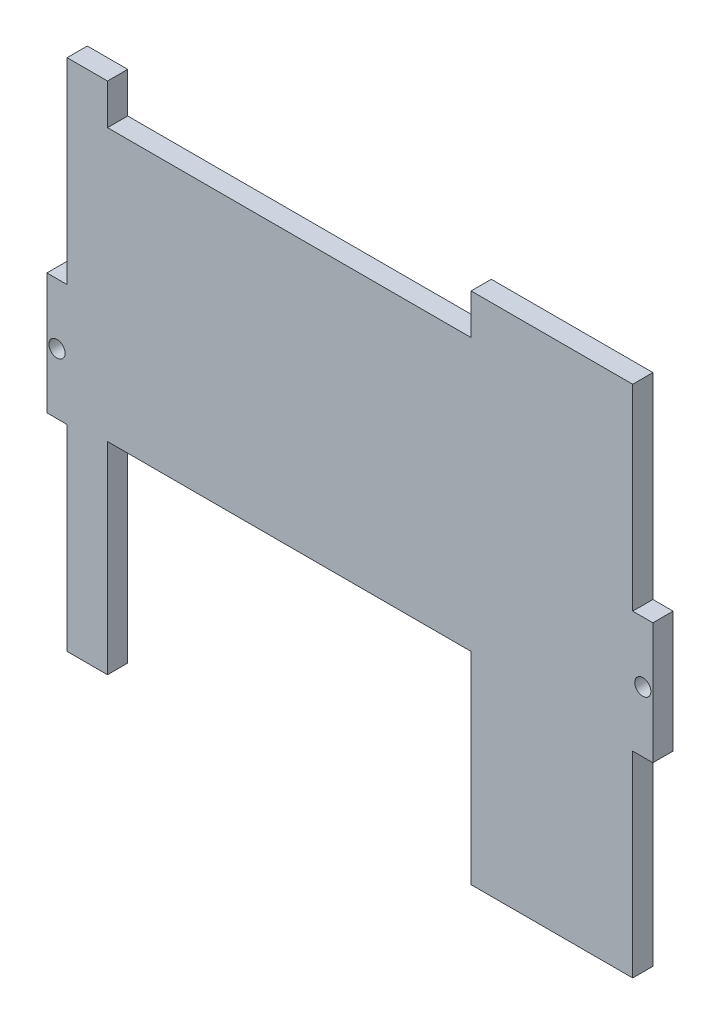
ISO-10303-21;
HEADER;
FILE_DESCRIPTION(('STEP AP214'),'2;1');
FILE_NAME('part.step','',(''),(''),'','','');
FILE_SCHEMA(('AUTOMOTIVE_DESIGN { 1 0 10303 214 1 1 1 1 }'));
ENDSEC;
DATA;
#1=APPLICATION_CONTEXT('core data for automotive mechanical design processes');
#2=APPLICATION_PROTOCOL_DEFINITION('international standard','automotive_design',2000,#1);
#3=PRODUCT_CONTEXT('',#1,'mechanical');
#4=PRODUCT('Part','Part','',(#3));
#5=PRODUCT_RELATED_PRODUCT_CATEGORY('part','',(#4));
#6=PRODUCT_DEFINITION_FORMATION('','',#4);
#7=PRODUCT_DEFINITION_CONTEXT('part definition',#1,'design');
#8=PRODUCT_DEFINITION('design','',#6,#7);
#9=PRODUCT_DEFINITION_SHAPE('','',#8);
#10=(LENGTH_UNIT() NAMED_UNIT(*) SI_UNIT(.MILLI.,.METRE.));
#11=(NAMED_UNIT(*) PLANE_ANGLE_UNIT() SI_UNIT($,.RADIAN.));
#12=(NAMED_UNIT(*) SI_UNIT($,.STERADIAN.) SOLID_ANGLE_UNIT());
#13=UNCERTAINTY_MEASURE_WITH_UNIT(LENGTH_MEASURE(1.E-05),#10,'distance_accuracy_value','');
#14=(GEOMETRIC_REPRESENTATION_CONTEXT(3) GLOBAL_UNCERTAINTY_ASSIGNED_CONTEXT((#13)) GLOBAL_UNIT_ASSIGNED_CONTEXT((#10,
#11,#12)) REPRESENTATION_CONTEXT('',''));
#15=CARTESIAN_POINT('',(0.,0.,0.));
#16=DIRECTION('',(0.,0.,1.));
#17=DIRECTION('',(1.,0.,0.));
#18=AXIS2_PLACEMENT_3D('',#15,#16,#17);
#19=CARTESIAN_POINT('',(0.,-63.64,5.));
#20=DIRECTION('',(0.,1.,0.));
#21=DIRECTION('',(0.,0.,1.));
#22=AXIS2_PLACEMENT_3D('',#19,#20,#21);
#23=PLANE('',#22);
#24=DIRECTION('',(1.,0.,0.));
#25=VECTOR('',#24,1.);
#26=CARTESIAN_POINT('',(0.,-63.64,5.));
#27=LINE('',#26,#25);
#28=CARTESIAN_POINT('',(30.,-63.64,5.));
#29=VERTEX_POINT('',#28);
#30=CARTESIAN_POINT('',(70.,-63.64,5.));
#31=VERTEX_POINT('',#30);
#32=EDGE_CURVE('E274',#29,#31,#27,.T.);
#33=ORIENTED_EDGE('',*,*,#32,.F.);
#34=DIRECTION('',(0.,0.,1.));
#35=VECTOR('',#34,1.);
#36=CARTESIAN_POINT('',(30.,-63.64,0.));
#37=LINE('',#36,#35);
#38=CARTESIAN_POINT('',(30.,-63.64,0.));
#39=VERTEX_POINT('',#38);
#40=EDGE_CURVE('E201',#39,#29,#37,.T.);
#41=ORIENTED_EDGE('',*,*,#40,.F.);
#42=DIRECTION('',(1.,0.,0.));
#43=VECTOR('',#42,1.);
#44=CARTESIAN_POINT('',(0.,-63.64,0.));
#45=LINE('',#44,#43);
#46=CARTESIAN_POINT('',(70.,-63.64,0.));
#47=VERTEX_POINT('',#46);
#48=EDGE_CURVE('E192',#39,#47,#45,.T.);
#49=ORIENTED_EDGE('',*,*,#48,.T.);
#50=DIRECTION('',(0.,0.,-1.));
#51=VECTOR('',#50,1.);
#52=CARTESIAN_POINT('',(70.,-63.64,5.));
#53=LINE('',#52,#51);
#54=EDGE_CURVE('E278',#31,#47,#53,.T.);
#55=ORIENTED_EDGE('',*,*,#54,.F.);
#56=EDGE_LOOP('',(#33,#41,#49,#55));
#57=FACE_BOUND('',#56,.T.);
#58=ADVANCED_FACE('F35',(#57),#23,.F.);
#59=CARTESIAN_POINT('',(0.,63.64,5.));
#60=DIRECTION('',(0.,1.,0.));
#61=DIRECTION('',(0.,0.,1.));
#62=AXIS2_PLACEMENT_3D('',#59,#60,#61);
#63=PLANE('',#62);
#64=DIRECTION('',(0.,0.,1.));
#65=VECTOR('',#64,1.);
#66=CARTESIAN_POINT('',(-60.,63.64,0.));
#67=LINE('',#66,#65);
#68=CARTESIAN_POINT('',(-60.,63.64,0.));
#69=VERTEX_POINT('',#68);
#70=CARTESIAN_POINT('',(-60.,63.64,5.));
#71=VERTEX_POINT('',#70);
#72=EDGE_CURVE('E223',#69,#71,#67,.T.);
#73=ORIENTED_EDGE('',*,*,#72,.F.);
#74=DIRECTION('',(1.,0.,0.));
#75=VECTOR('',#74,1.);
#76=CARTESIAN_POINT('',(0.,63.64,0.));
#77=LINE('',#76,#75);
#78=CARTESIAN_POINT('',(-70.,63.64,0.));
#79=VERTEX_POINT('',#78);
#80=EDGE_CURVE('E292',#79,#69,#77,.T.);
#81=ORIENTED_EDGE('',*,*,#80,.F.);
#82=DIRECTION('',(0.,0.,-1.));
#83=VECTOR('',#82,1.);
#84=CARTESIAN_POINT('',(-70.,63.64,5.));
#85=LINE('',#84,#83);
#86=CARTESIAN_POINT('',(-70.,63.64,5.));
#87=VERTEX_POINT('',#86);
#88=EDGE_CURVE('E324',#87,#79,#85,.T.);
#89=ORIENTED_EDGE('',*,*,#88,.F.);
#90=DIRECTION('',(1.,0.,0.));
#91=VECTOR('',#90,1.);
#92=CARTESIAN_POINT('',(0.,63.64,5.));
#93=LINE('',#92,#91);
#94=EDGE_CURVE('E259',#87,#71,#93,.T.);
#95=ORIENTED_EDGE('',*,*,#94,.T.);
#96=EDGE_LOOP('',(#73,#81,#89,#95));
#97=FACE_BOUND('',#96,.T.);
#98=ADVANCED_FACE('F371',(#97),#63,.T.);
#99=CARTESIAN_POINT('',(70.,0.,5.));
#100=DIRECTION('',(1.,0.,0.));
#101=DIRECTION('',(0.,0.,-1.));
#102=AXIS2_PLACEMENT_3D('',#99,#100,#101);
#103=PLANE('',#102);
#104=DIRECTION('',(0.,-1.,0.));
#105=VECTOR('',#104,1.);
#106=CARTESIAN_POINT('',(70.,0.,0.));
#107=LINE('',#106,#105);
#108=CARTESIAN_POINT('',(70.,-15.,0.));
#109=VERTEX_POINT('',#108);
#110=EDGE_CURVE('E241',#109,#47,#107,.T.);
#111=ORIENTED_EDGE('',*,*,#110,.F.);
#112=DIRECTION('',(0.,0.,-1.));
#113=VECTOR('',#112,1.);
#114=CARTESIAN_POINT('',(70.,-15.,5.));
#115=LINE('',#114,#113);
#116=CARTESIAN_POINT('',(70.,-15.,5.));
#117=VERTEX_POINT('',#116);
#118=EDGE_CURVE('E11',#117,#109,#115,.T.);
#119=ORIENTED_EDGE('',*,*,#118,.F.);
#120=DIRECTION('',(0.,-1.,0.));
#121=VECTOR('',#120,1.);
#122=CARTESIAN_POINT('',(70.,0.,5.));
#123=LINE('',#122,#121);
#124=EDGE_CURVE('E244',#117,#31,#123,.T.);
#125=ORIENTED_EDGE('',*,*,#124,.T.);
#126=ORIENTED_EDGE('',*,*,#54,.T.);
#127=EDGE_LOOP('',(#111,#119,#125,#126));
#128=FACE_BOUND('',#127,.T.);
#129=ADVANCED_FACE('F37',(#128),#103,.T.);
#130=CARTESIAN_POINT('',(0.,-15.,5.));
#131=DIRECTION('',(0.,1.,0.));
#132=DIRECTION('',(0.,0.,1.));
#133=AXIS2_PLACEMENT_3D('',#130,#131,#132);
#134=PLANE('',#133);
#135=DIRECTION('',(1.,0.,0.));
#136=VECTOR('',#135,1.);
#137=CARTESIAN_POINT('',(0.,-15.,0.));
#138=LINE('',#137,#136);
#139=CARTESIAN_POINT('',(75.,-15.,0.));
#140=VERTEX_POINT('',#139);
#141=EDGE_CURVE('E280',#109,#140,#138,.T.);
#142=ORIENTED_EDGE('',*,*,#141,.T.);
#143=DIRECTION('',(0.,0.,-1.));
#144=VECTOR('',#143,1.);
#145=CARTESIAN_POINT('',(75.,-15.,5.));
#146=LINE('',#145,#144);
#147=CARTESIAN_POINT('',(75.,-15.,5.));
#148=VERTEX_POINT('',#147);
#149=EDGE_CURVE('E43',#148,#140,#146,.T.);
#150=ORIENTED_EDGE('',*,*,#149,.F.);
#151=DIRECTION('',(1.,0.,0.));
#152=VECTOR('',#151,1.);
#153=CARTESIAN_POINT('',(0.,-15.,5.));
#154=LINE('',#153,#152);
#155=EDGE_CURVE('E247',#117,#148,#154,.T.);
#156=ORIENTED_EDGE('',*,*,#155,.F.);
#157=ORIENTED_EDGE('',*,*,#118,.T.);
#158=EDGE_LOOP('',(#142,#150,#156,#157));
#159=FACE_BOUND('',#158,.T.);
#160=ADVANCED_FACE('F473',(#159),#134,.F.);
#161=CARTESIAN_POINT('',(75.,0.,5.));
#162=DIRECTION('',(-1.,0.,0.));
#163=DIRECTION('',(0.,0.,1.));
#164=AXIS2_PLACEMENT_3D('',#161,#162,#163);
#165=PLANE('',#164);
#166=DIRECTION('',(0.,1.,0.));
#167=VECTOR('',#166,1.);
#168=CARTESIAN_POINT('',(75.,0.,0.));
#169=LINE('',#168,#167);
#170=CARTESIAN_POINT('',(75.,15.,0.));
#171=VERTEX_POINT('',#170);
#172=EDGE_CURVE('E282',#140,#171,#169,.T.);
#173=ORIENTED_EDGE('',*,*,#172,.T.);
#174=DIRECTION('',(0.,0.,-1.));
#175=VECTOR('',#174,1.);
#176=CARTESIAN_POINT('',(75.,15.,5.));
#177=LINE('',#176,#175);
#178=CARTESIAN_POINT('',(75.,15.,5.));
#179=VERTEX_POINT('',#178);
#180=EDGE_CURVE('E331',#179,#171,#177,.T.);
#181=ORIENTED_EDGE('',*,*,#180,.F.);
#182=DIRECTION('',(0.,1.,0.));
#183=VECTOR('',#182,1.);
#184=CARTESIAN_POINT('',(75.,0.,5.));
#185=LINE('',#184,#183);
#186=EDGE_CURVE('E250',#148,#179,#185,.T.);
#187=ORIENTED_EDGE('',*,*,#186,.F.);
#188=ORIENTED_EDGE('',*,*,#149,.T.);
#189=EDGE_LOOP('',(#173,#181,#187,#188));
#190=FACE_BOUND('',#189,.T.);
#191=ADVANCED_FACE('F337',(#190),#165,.F.);
#192=CARTESIAN_POINT('',(0.,15.,5.));
#193=DIRECTION('',(0.,1.,0.));
#194=DIRECTION('',(0.,0.,1.));
#195=AXIS2_PLACEMENT_3D('',#192,#193,#194);
#196=PLANE('',#195);
#197=DIRECTION('',(1.,0.,0.));
#198=VECTOR('',#197,1.);
#199=CARTESIAN_POINT('',(0.,15.,0.));
#200=LINE('',#199,#198);
#201=CARTESIAN_POINT('',(70.,15.,0.));
#202=VERTEX_POINT('',#201);
#203=EDGE_CURVE('E285',#202,#171,#200,.T.);
#204=ORIENTED_EDGE('',*,*,#203,.F.);
#205=DIRECTION('',(0.,0.,-1.));
#206=VECTOR('',#205,1.);
#207=CARTESIAN_POINT('',(70.,15.,5.));
#208=LINE('',#207,#206);
#209=CARTESIAN_POINT('',(70.,15.,5.));
#210=VERTEX_POINT('',#209);
#211=EDGE_CURVE('E329',#210,#202,#208,.T.);
#212=ORIENTED_EDGE('',*,*,#211,.F.);
#213=DIRECTION('',(1.,0.,0.));
#214=VECTOR('',#213,1.);
#215=CARTESIAN_POINT('',(0.,15.,5.));
#216=LINE('',#215,#214);
#217=EDGE_CURVE('E252',#210,#179,#216,.T.);
#218=ORIENTED_EDGE('',*,*,#217,.T.);
#219=ORIENTED_EDGE('',*,*,#180,.T.);
#220=EDGE_LOOP('',(#204,#212,#218,#219));
#221=FACE_BOUND('',#220,.T.);
#222=ADVANCED_FACE('F346',(#221),#196,.T.);
#223=CARTESIAN_POINT('',(70.,0.,5.));
#224=DIRECTION('',(1.,0.,0.));
#225=DIRECTION('',(0.,0.,-1.));
#226=AXIS2_PLACEMENT_3D('',#223,#224,#225);
#227=PLANE('',#226);
#228=DIRECTION('',(0.,-1.,0.));
#229=VECTOR('',#228,1.);
#230=CARTESIAN_POINT('',(70.,0.,0.));
#231=LINE('',#230,#229);
#232=CARTESIAN_POINT('',(70.,63.64,0.));
#233=VERTEX_POINT('',#232);
#234=EDGE_CURVE('E288',#233,#202,#231,.T.);
#235=ORIENTED_EDGE('',*,*,#234,.F.);
#236=DIRECTION('',(0.,0.,-1.));
#237=VECTOR('',#236,1.);
#238=CARTESIAN_POINT('',(70.,63.64,5.));
#239=LINE('',#238,#237);
#240=CARTESIAN_POINT('',(70.,63.64,5.));
#241=VERTEX_POINT('',#240);
#242=EDGE_CURVE('E326',#241,#233,#239,.T.);
#243=ORIENTED_EDGE('',*,*,#242,.F.);
#244=DIRECTION('',(0.,-1.,0.));
#245=VECTOR('',#244,1.);
#246=CARTESIAN_POINT('',(70.,0.,5.));
#247=LINE('',#246,#245);
#248=EDGE_CURVE('E255',#241,#210,#247,.T.);
#249=ORIENTED_EDGE('',*,*,#248,.T.);
#250=ORIENTED_EDGE('',*,*,#211,.T.);
#251=EDGE_LOOP('',(#235,#243,#249,#250));
#252=FACE_BOUND('',#251,.T.);
#253=ADVANCED_FACE('F355',(#252),#227,.T.);
#254=DIRECTION('',(0.,0.,1.));
#255=VECTOR('',#254,1.);
#256=CARTESIAN_POINT('',(30.,63.64,0.));
#257=LINE('',#256,#255);
#258=CARTESIAN_POINT('',(30.,63.64,0.));
#259=VERTEX_POINT('',#258);
#260=CARTESIAN_POINT('',(30.,63.64,5.));
#261=VERTEX_POINT('',#260);
#262=EDGE_CURVE('E226',#259,#261,#257,.T.);
#263=ORIENTED_EDGE('',*,*,#262,.T.);
#264=EDGE_CURVE('E258',#261,#241,#93,.T.);
#265=ORIENTED_EDGE('',*,*,#264,.T.);
#266=ORIENTED_EDGE('',*,*,#242,.T.);
#267=EDGE_CURVE('E291',#259,#233,#77,.T.);
#268=ORIENTED_EDGE('',*,*,#267,.F.);
#269=EDGE_LOOP('',(#263,#265,#266,#268));
#270=FACE_BOUND('',#269,.T.);
#271=ADVANCED_FACE('F358',(#270),#63,.T.);
#272=CARTESIAN_POINT('',(-70.,0.,5.));
#273=DIRECTION('',(1.,0.,0.));
#274=DIRECTION('',(0.,0.,-1.));
#275=AXIS2_PLACEMENT_3D('',#272,#273,#274);
#276=PLANE('',#275);
#277=DIRECTION('',(0.,-1.,0.));
#278=VECTOR('',#277,1.);
#279=CARTESIAN_POINT('',(-70.,0.,0.));
#280=LINE('',#279,#278);
#281=CARTESIAN_POINT('',(-70.,15.,0.));
#282=VERTEX_POINT('',#281);
#283=EDGE_CURVE('E295',#79,#282,#280,.T.);
#284=ORIENTED_EDGE('',*,*,#283,.T.);
#285=DIRECTION('',(0.,0.,-1.));
#286=VECTOR('',#285,1.);
#287=CARTESIAN_POINT('',(-70.,15.,5.));
#288=LINE('',#287,#286);
#289=CARTESIAN_POINT('',(-70.,15.,5.));
#290=VERTEX_POINT('',#289);
#291=EDGE_CURVE('E322',#290,#282,#288,.T.);
#292=ORIENTED_EDGE('',*,*,#291,.F.);
#293=DIRECTION('',(0.,-1.,0.));
#294=VECTOR('',#293,1.);
#295=CARTESIAN_POINT('',(-70.,0.,5.));
#296=LINE('',#295,#294);
#297=EDGE_CURVE('E262',#87,#290,#296,.T.);
#298=ORIENTED_EDGE('',*,*,#297,.F.);
#299=ORIENTED_EDGE('',*,*,#88,.T.);
#300=EDGE_LOOP('',(#284,#292,#298,#299));
#301=FACE_BOUND('',#300,.T.);
#302=ADVANCED_FACE('F377',(#301),#276,.F.);
#303=CARTESIAN_POINT('',(0.,15.,5.));
#304=DIRECTION('',(0.,1.,0.));
#305=DIRECTION('',(0.,0.,1.));
#306=AXIS2_PLACEMENT_3D('',#303,#304,#305);
#307=PLANE('',#306);
#308=DIRECTION('',(1.,0.,0.));
#309=VECTOR('',#308,1.);
#310=CARTESIAN_POINT('',(0.,15.,0.));
#311=LINE('',#310,#309);
#312=CARTESIAN_POINT('',(-75.,15.,0.));
#313=VERTEX_POINT('',#312);
#314=EDGE_CURVE('E298',#313,#282,#311,.T.);
#315=ORIENTED_EDGE('',*,*,#314,.F.);
#316=DIRECTION('',(0.,0.,-1.));
#317=VECTOR('',#316,1.);
#318=CARTESIAN_POINT('',(-75.,15.,5.));
#319=LINE('',#318,#317);
#320=CARTESIAN_POINT('',(-75.,15.,5.));
#321=VERTEX_POINT('',#320);
#322=EDGE_CURVE('E320',#321,#313,#319,.T.);
#323=ORIENTED_EDGE('',*,*,#322,.F.);
#324=DIRECTION('',(1.,0.,0.));
#325=VECTOR('',#324,1.);
#326=CARTESIAN_POINT('',(0.,15.,5.));
#327=LINE('',#326,#325);
#328=EDGE_CURVE('E264',#321,#290,#327,.T.);
#329=ORIENTED_EDGE('',*,*,#328,.T.);
#330=ORIENTED_EDGE('',*,*,#291,.T.);
#331=EDGE_LOOP('',(#315,#323,#329,#330));
#332=FACE_BOUND('',#331,.T.);
#333=ADVANCED_FACE('F401',(#332),#307,.T.);
#334=CARTESIAN_POINT('',(-75.,0.,5.));
#335=DIRECTION('',(-1.,0.,0.));
#336=DIRECTION('',(0.,0.,1.));
#337=AXIS2_PLACEMENT_3D('',#334,#335,#336);
#338=PLANE('',#337);
#339=DIRECTION('',(0.,1.,0.));
#340=VECTOR('',#339,1.);
#341=CARTESIAN_POINT('',(-75.,0.,0.));
#342=LINE('',#341,#340);
#343=CARTESIAN_POINT('',(-75.,-15.,0.));
#344=VERTEX_POINT('',#343);
#345=EDGE_CURVE('E301',#344,#313,#342,.T.);
#346=ORIENTED_EDGE('',*,*,#345,.F.);
#347=DIRECTION('',(0.,0.,-1.));
#348=VECTOR('',#347,1.);
#349=CARTESIAN_POINT('',(-75.,-15.,5.));
#350=LINE('',#349,#348);
#351=CARTESIAN_POINT('',(-75.,-15.,5.));
#352=VERTEX_POINT('',#351);
#353=EDGE_CURVE('E318',#352,#344,#350,.T.);
#354=ORIENTED_EDGE('',*,*,#353,.F.);
#355=DIRECTION('',(0.,1.,0.));
#356=VECTOR('',#355,1.);
#357=CARTESIAN_POINT('',(-75.,0.,5.));
#358=LINE('',#357,#356);
#359=EDGE_CURVE('E267',#352,#321,#358,.T.);
#360=ORIENTED_EDGE('',*,*,#359,.T.);
#361=ORIENTED_EDGE('',*,*,#322,.T.);
#362=EDGE_LOOP('',(#346,#354,#360,#361));
#363=FACE_BOUND('',#362,.T.);
#364=ADVANCED_FACE('F383',(#363),#338,.T.);
#365=CARTESIAN_POINT('',(0.,-15.,5.));
#366=DIRECTION('',(0.,1.,0.));
#367=DIRECTION('',(0.,0.,1.));
#368=AXIS2_PLACEMENT_3D('',#365,#366,#367);
#369=PLANE('',#368);
#370=DIRECTION('',(1.,0.,0.));
#371=VECTOR('',#370,1.);
#372=CARTESIAN_POINT('',(0.,-15.,0.));
#373=LINE('',#372,#371);
#374=CARTESIAN_POINT('',(-70.,-15.,0.));
#375=VERTEX_POINT('',#374);
#376=EDGE_CURVE('E304',#344,#375,#373,.T.);
#377=ORIENTED_EDGE('',*,*,#376,.T.);
#378=DIRECTION('',(0.,0.,-1.));
#379=VECTOR('',#378,1.);
#380=CARTESIAN_POINT('',(-70.,-15.,5.));
#381=LINE('',#380,#379);
#382=CARTESIAN_POINT('',(-70.,-15.,5.));
#383=VERTEX_POINT('',#382);
#384=EDGE_CURVE('E315',#383,#375,#381,.T.);
#385=ORIENTED_EDGE('',*,*,#384,.F.);
#386=DIRECTION('',(1.,0.,0.));
#387=VECTOR('',#386,1.);
#388=CARTESIAN_POINT('',(0.,-15.,5.));
#389=LINE('',#388,#387);
#390=EDGE_CURVE('E270',#352,#383,#389,.T.);
#391=ORIENTED_EDGE('',*,*,#390,.F.);
#392=ORIENTED_EDGE('',*,*,#353,.T.);
#393=EDGE_LOOP('',(#377,#385,#391,#392));
#394=FACE_BOUND('',#393,.T.);
#395=ADVANCED_FACE('F389',(#394),#369,.F.);
#396=CARTESIAN_POINT('',(-70.,0.,5.));
#397=DIRECTION('',(1.,0.,0.));
#398=DIRECTION('',(0.,0.,-1.));
#399=AXIS2_PLACEMENT_3D('',#396,#397,#398);
#400=PLANE('',#399);
#401=DIRECTION('',(0.,-1.,0.));
#402=VECTOR('',#401,1.);
#403=CARTESIAN_POINT('',(-70.,0.,0.));
#404=LINE('',#403,#402);
#405=CARTESIAN_POINT('',(-70.,-63.64,0.));
#406=VERTEX_POINT('',#405);
#407=EDGE_CURVE('E306',#375,#406,#404,.T.);
#408=ORIENTED_EDGE('',*,*,#407,.T.);
#409=DIRECTION('',(0.,0.,-1.));
#410=VECTOR('',#409,1.);
#411=CARTESIAN_POINT('',(-70.,-63.64,5.));
#412=LINE('',#411,#410);
#413=CARTESIAN_POINT('',(-70.,-63.64,5.));
#414=VERTEX_POINT('',#413);
#415=EDGE_CURVE('E312',#414,#406,#412,.T.);
#416=ORIENTED_EDGE('',*,*,#415,.F.);
#417=DIRECTION('',(0.,-1.,0.));
#418=VECTOR('',#417,1.);
#419=CARTESIAN_POINT('',(-70.,0.,5.));
#420=LINE('',#419,#418);
#421=EDGE_CURVE('E272',#383,#414,#420,.T.);
#422=ORIENTED_EDGE('',*,*,#421,.F.);
#423=ORIENTED_EDGE('',*,*,#384,.T.);
#424=EDGE_LOOP('',(#408,#416,#422,#423));
#425=FACE_BOUND('',#424,.T.);
#426=ADVANCED_FACE('F395',(#425),#400,.F.);
#427=CARTESIAN_POINT('',(-60.,-63.64,0.));
#428=VERTEX_POINT('',#427);
#429=EDGE_CURVE('E248',#406,#428,#45,.T.);
#430=ORIENTED_EDGE('',*,*,#429,.T.);
#431=DIRECTION('',(0.,0.,1.));
#432=VECTOR('',#431,1.);
#433=CARTESIAN_POINT('',(-60.,-63.64,0.));
#434=LINE('',#433,#432);
#435=CARTESIAN_POINT('',(-60.,-63.64,5.));
#436=VERTEX_POINT('',#435);
#437=EDGE_CURVE('E204',#428,#436,#434,.T.);
#438=ORIENTED_EDGE('',*,*,#437,.T.);
#439=EDGE_CURVE('E275',#414,#436,#27,.T.);
#440=ORIENTED_EDGE('',*,*,#439,.F.);
#441=ORIENTED_EDGE('',*,*,#415,.T.);
#442=EDGE_LOOP('',(#430,#438,#440,#441));
#443=FACE_BOUND('',#442,.T.);
#444=ADVANCED_FACE('F399',(#443),#23,.F.);
#445=CARTESIAN_POINT('',(0.,0.,5.));
#446=DIRECTION('',(0.,0.,1.));
#447=DIRECTION('',(1.,0.,0.));
#448=AXIS2_PLACEMENT_3D('',#445,#446,#447);
#449=PLANE('',#448);
#450=DIRECTION('',(0.,1.,0.));
#451=VECTOR('',#450,1.);
#452=CARTESIAN_POINT('',(30.,-13.64,5.));
#453=LINE('',#452,#451);
#454=CARTESIAN_POINT('',(30.,-13.64,5.));
#455=VERTEX_POINT('',#454);
#456=EDGE_CURVE('E177',#29,#455,#453,.T.);
#457=ORIENTED_EDGE('',*,*,#456,.F.);
#458=ORIENTED_EDGE('',*,*,#32,.T.);
#459=ORIENTED_EDGE('',*,*,#124,.F.);
#460=ORIENTED_EDGE('',*,*,#155,.T.);
#461=ORIENTED_EDGE('',*,*,#186,.T.);
#462=ORIENTED_EDGE('',*,*,#217,.F.);
#463=ORIENTED_EDGE('',*,*,#248,.F.);
#464=ORIENTED_EDGE('',*,*,#264,.F.);
#465=DIRECTION('',(0.,1.,0.));
#466=VECTOR('',#465,1.);
#467=CARTESIAN_POINT('',(30.,53.64,5.));
#468=LINE('',#467,#466);
#469=CARTESIAN_POINT('',(30.,53.64,5.));
#470=VERTEX_POINT('',#469);
#471=EDGE_CURVE('E212',#470,#261,#468,.T.);
#472=ORIENTED_EDGE('',*,*,#471,.F.);
#473=DIRECTION('',(1.,0.,0.));
#474=VECTOR('',#473,1.);
#475=CARTESIAN_POINT('',(30.,53.64,5.));
#476=LINE('',#475,#474);
#477=CARTESIAN_POINT('',(-60.,53.64,5.));
#478=VERTEX_POINT('',#477);
#479=EDGE_CURVE('E219',#478,#470,#476,.T.);
#480=ORIENTED_EDGE('',*,*,#479,.F.);
#481=DIRECTION('',(0.,-1.,0.));
#482=VECTOR('',#481,1.);
#483=CARTESIAN_POINT('',(-60.,53.64,5.));
#484=LINE('',#483,#482);
#485=EDGE_CURVE('E203',#71,#478,#484,.T.);
#486=ORIENTED_EDGE('',*,*,#485,.F.);
#487=ORIENTED_EDGE('',*,*,#94,.F.);
#488=ORIENTED_EDGE('',*,*,#297,.T.);
#489=ORIENTED_EDGE('',*,*,#328,.F.);
#490=ORIENTED_EDGE('',*,*,#359,.F.);
#491=ORIENTED_EDGE('',*,*,#390,.T.);
#492=ORIENTED_EDGE('',*,*,#421,.T.);
#493=ORIENTED_EDGE('',*,*,#439,.T.);
#494=DIRECTION('',(0.,-1.,0.));
#495=VECTOR('',#494,1.);
#496=CARTESIAN_POINT('',(-60.,-13.64,5.));
#497=LINE('',#496,#495);
#498=CARTESIAN_POINT('',(-60.,-13.64,5.));
#499=VERTEX_POINT('',#498);
#500=EDGE_CURVE('E193',#499,#436,#497,.T.);
#501=ORIENTED_EDGE('',*,*,#500,.F.);
#502=DIRECTION('',(-1.,0.,0.));
#503=VECTOR('',#502,1.);
#504=CARTESIAN_POINT('',(30.,-13.64,5.));
#505=LINE('',#504,#503);
#506=EDGE_CURVE('E195',#455,#499,#505,.T.);
#507=ORIENTED_EDGE('',*,*,#506,.F.);
#508=EDGE_LOOP('',(#457,#458,#459,#460,#461,#462,#463,#464,#472,#480,#486,#487,#488,#489,#490,
#491,#492,#493,#501,#507));
#509=FACE_BOUND('',#508,.T.);
#510=CARTESIAN_POINT('',(72.5,0.,5.));
#511=DIRECTION('',(0.,0.,1.));
#512=DIRECTION('',(-1.,0.,0.));
#513=AXIS2_PLACEMENT_3D('',#510,#511,#512);
#514=CIRCLE('',#513,2.);
#515=CARTESIAN_POINT('',(70.5,0.,5.));
#516=VERTEX_POINT('',#515);
#517=EDGE_CURVE('E225',#516,#516,#514,.T.);
#518=ORIENTED_EDGE('',*,*,#517,.F.);
#519=EDGE_LOOP('',(#518));
#520=FACE_BOUND('',#519,.T.);
#521=CARTESIAN_POINT('',(-72.5,0.,5.));
#522=DIRECTION('',(0.,0.,1.));
#523=DIRECTION('',(1.,0.,0.));
#524=AXIS2_PLACEMENT_3D('',#521,#522,#523);
#525=CIRCLE('',#524,2.);
#526=CARTESIAN_POINT('',(-70.5,0.,5.));
#527=VERTEX_POINT('',#526);
#528=EDGE_CURVE('E235',#527,#527,#525,.T.);
#529=ORIENTED_EDGE('',*,*,#528,.F.);
#530=EDGE_LOOP('',(#529));
#531=FACE_BOUND('',#530,.T.);
#532=ADVANCED_FACE('F350',(#509,#520,#531),#449,.T.);
#533=CARTESIAN_POINT('',(0.,0.,0.));
#534=DIRECTION('',(0.,0.,1.));
#535=DIRECTION('',(1.,0.,0.));
#536=AXIS2_PLACEMENT_3D('',#533,#534,#535);
#537=PLANE('',#536);
#538=ORIENTED_EDGE('',*,*,#48,.F.);
#539=DIRECTION('',(0.,1.,0.));
#540=VECTOR('',#539,1.);
#541=CARTESIAN_POINT('',(30.,-13.64,0.));
#542=LINE('',#541,#540);
#543=CARTESIAN_POINT('',(30.,-13.64,0.));
#544=VERTEX_POINT('',#543);
#545=EDGE_CURVE('E174',#39,#544,#542,.T.);
#546=ORIENTED_EDGE('',*,*,#545,.T.);
#547=DIRECTION('',(-1.,0.,0.));
#548=VECTOR('',#547,1.);
#549=CARTESIAN_POINT('',(30.,-13.64,0.));
#550=LINE('',#549,#548);
#551=CARTESIAN_POINT('',(-60.,-13.64,0.));
#552=VERTEX_POINT('',#551);
#553=EDGE_CURVE('E184',#544,#552,#550,.T.);
#554=ORIENTED_EDGE('',*,*,#553,.T.);
#555=DIRECTION('',(0.,-1.,0.));
#556=VECTOR('',#555,1.);
#557=CARTESIAN_POINT('',(-60.,-13.64,0.));
#558=LINE('',#557,#556);
#559=EDGE_CURVE('E50',#552,#428,#558,.T.);
#560=ORIENTED_EDGE('',*,*,#559,.T.);
#561=ORIENTED_EDGE('',*,*,#429,.F.);
#562=ORIENTED_EDGE('',*,*,#407,.F.);
#563=ORIENTED_EDGE('',*,*,#376,.F.);
#564=ORIENTED_EDGE('',*,*,#345,.T.);
#565=ORIENTED_EDGE('',*,*,#314,.T.);
#566=ORIENTED_EDGE('',*,*,#283,.F.);
#567=ORIENTED_EDGE('',*,*,#80,.T.);
#568=DIRECTION('',(0.,-1.,0.));
#569=VECTOR('',#568,1.);
#570=CARTESIAN_POINT('',(-60.,53.64,0.));
#571=LINE('',#570,#569);
#572=CARTESIAN_POINT('',(-60.,53.64,0.));
#573=VERTEX_POINT('',#572);
#574=EDGE_CURVE('E208',#69,#573,#571,.T.);
#575=ORIENTED_EDGE('',*,*,#574,.T.);
#576=DIRECTION('',(1.,0.,0.));
#577=VECTOR('',#576,1.);
#578=CARTESIAN_POINT('',(30.,53.64,0.));
#579=LINE('',#578,#577);
#580=CARTESIAN_POINT('',(30.,53.64,0.));
#581=VERTEX_POINT('',#580);
#582=EDGE_CURVE('E211',#573,#581,#579,.T.);
#583=ORIENTED_EDGE('',*,*,#582,.T.);
#584=DIRECTION('',(0.,1.,0.));
#585=VECTOR('',#584,1.);
#586=CARTESIAN_POINT('',(30.,53.64,0.));
#587=LINE('',#586,#585);
#588=EDGE_CURVE('E58',#581,#259,#587,.T.);
#589=ORIENTED_EDGE('',*,*,#588,.T.);
#590=ORIENTED_EDGE('',*,*,#267,.T.);
#591=ORIENTED_EDGE('',*,*,#234,.T.);
#592=ORIENTED_EDGE('',*,*,#203,.T.);
#593=ORIENTED_EDGE('',*,*,#172,.F.);
#594=ORIENTED_EDGE('',*,*,#141,.F.);
#595=ORIENTED_EDGE('',*,*,#110,.T.);
#596=EDGE_LOOP('',(#538,#546,#554,#560,#561,#562,#563,#564,#565,#566,#567,#575,#583,#589,#590,
#591,#592,#593,#594,#595));
#597=FACE_BOUND('',#596,.T.);
#598=CARTESIAN_POINT('',(72.5,0.,0.));
#599=DIRECTION('',(0.,0.,1.));
#600=DIRECTION('',(-1.,0.,0.));
#601=AXIS2_PLACEMENT_3D('',#598,#599,#600);
#602=CIRCLE('',#601,2.);
#603=CARTESIAN_POINT('',(70.5,0.,0.));
#604=VERTEX_POINT('',#603);
#605=EDGE_CURVE('E232',#604,#604,#602,.T.);
#606=ORIENTED_EDGE('',*,*,#605,.T.);
#607=EDGE_LOOP('',(#606));
#608=FACE_BOUND('',#607,.T.);
#609=CARTESIAN_POINT('',(-72.5,0.,0.));
#610=DIRECTION('',(0.,0.,1.));
#611=DIRECTION('',(1.,0.,0.));
#612=AXIS2_PLACEMENT_3D('',#609,#610,#611);
#613=CIRCLE('',#612,2.);
#614=CARTESIAN_POINT('',(-70.5,0.,0.));
#615=VERTEX_POINT('',#614);
#616=EDGE_CURVE('E238',#615,#615,#613,.T.);
#617=ORIENTED_EDGE('',*,*,#616,.T.);
#618=EDGE_LOOP('',(#617));
#619=FACE_BOUND('',#618,.T.);
#620=ADVANCED_FACE('F189',(#597,#608,#619),#537,.F.);
#621=CARTESIAN_POINT('',(-72.5,0.,0.));
#622=DIRECTION('',(0.,0.,1.));
#623=DIRECTION('',(1.,0.,0.));
#624=AXIS2_PLACEMENT_3D('',#621,#622,#623);
#625=CYLINDRICAL_SURFACE('',#624,2.);
#626=ORIENTED_EDGE('',*,*,#616,.F.);
#627=EDGE_LOOP('',(#626));
#628=FACE_BOUND('',#627,.T.);
#629=ORIENTED_EDGE('',*,*,#528,.T.);
#630=EDGE_LOOP('',(#629));
#631=FACE_BOUND('',#630,.T.);
#632=ADVANCED_FACE('F523',(#628,#631),#625,.F.);
#633=CARTESIAN_POINT('',(72.5,0.,0.));
#634=DIRECTION('',(0.,0.,1.));
#635=DIRECTION('',(1.,0.,0.));
#636=AXIS2_PLACEMENT_3D('',#633,#634,#635);
#637=CYLINDRICAL_SURFACE('',#636,2.);
#638=ORIENTED_EDGE('',*,*,#605,.F.);
#639=EDGE_LOOP('',(#638));
#640=FACE_BOUND('',#639,.T.);
#641=ORIENTED_EDGE('',*,*,#517,.T.);
#642=EDGE_LOOP('',(#641));
#643=FACE_BOUND('',#642,.T.);
#644=ADVANCED_FACE('F533',(#640,#643),#637,.F.);
#645=CARTESIAN_POINT('',(-60.,53.64,0.));
#646=DIRECTION('',(-1.,0.,0.));
#647=DIRECTION('',(0.,-1.,0.));
#648=AXIS2_PLACEMENT_3D('',#645,#646,#647);
#649=PLANE('',#648);
#650=ORIENTED_EDGE('',*,*,#485,.T.);
#651=DIRECTION('',(0.,0.,1.));
#652=VECTOR('',#651,1.);
#653=CARTESIAN_POINT('',(-60.,53.64,0.));
#654=LINE('',#653,#652);
#655=EDGE_CURVE('E216',#573,#478,#654,.T.);
#656=ORIENTED_EDGE('',*,*,#655,.F.);
#657=ORIENTED_EDGE('',*,*,#574,.F.);
#658=ORIENTED_EDGE('',*,*,#72,.T.);
#659=EDGE_LOOP('',(#650,#656,#657,#658));
#660=FACE_BOUND('',#659,.T.);
#661=ADVANCED_FACE('F367',(#660),#649,.F.);
#662=CARTESIAN_POINT('',(30.,53.64,0.));
#663=DIRECTION('',(1.,0.,0.));
#664=DIRECTION('',(0.,1.,0.));
#665=AXIS2_PLACEMENT_3D('',#662,#663,#664);
#666=PLANE('',#665);
#667=ORIENTED_EDGE('',*,*,#471,.T.);
#668=ORIENTED_EDGE('',*,*,#262,.F.);
#669=ORIENTED_EDGE('',*,*,#588,.F.);
#670=DIRECTION('',(0.,0.,1.));
#671=VECTOR('',#670,1.);
#672=CARTESIAN_POINT('',(30.,53.64,0.));
#673=LINE('',#672,#671);
#674=EDGE_CURVE('E229',#581,#470,#673,.T.);
#675=ORIENTED_EDGE('',*,*,#674,.T.);
#676=EDGE_LOOP('',(#667,#668,#669,#675));
#677=FACE_BOUND('',#676,.T.);
#678=ADVANCED_FACE('F362',(#677),#666,.F.);
#679=CARTESIAN_POINT('',(30.,53.64,0.));
#680=DIRECTION('',(0.,-1.,0.));
#681=DIRECTION('',(0.,0.,-1.));
#682=AXIS2_PLACEMENT_3D('',#679,#680,#681);
#683=PLANE('',#682);
#684=ORIENTED_EDGE('',*,*,#479,.T.);
#685=ORIENTED_EDGE('',*,*,#674,.F.);
#686=ORIENTED_EDGE('',*,*,#582,.F.);
#687=ORIENTED_EDGE('',*,*,#655,.T.);
#688=EDGE_LOOP('',(#684,#685,#686,#687));
#689=FACE_BOUND('',#688,.T.);
#690=ADVANCED_FACE('F365',(#689),#683,.F.);
#691=CARTESIAN_POINT('',(30.,-13.64,0.));
#692=DIRECTION('',(1.,0.,0.));
#693=DIRECTION('',(0.,0.,-1.));
#694=AXIS2_PLACEMENT_3D('',#691,#692,#693);
#695=PLANE('',#694);
#696=ORIENTED_EDGE('',*,*,#456,.T.);
#697=DIRECTION('',(0.,0.,1.));
#698=VECTOR('',#697,1.);
#699=CARTESIAN_POINT('',(30.,-13.64,0.));
#700=LINE('',#699,#698);
#701=EDGE_CURVE('E170',#544,#455,#700,.T.);
#702=ORIENTED_EDGE('',*,*,#701,.F.);
#703=ORIENTED_EDGE('',*,*,#545,.F.);
#704=ORIENTED_EDGE('',*,*,#40,.T.);
#705=EDGE_LOOP('',(#696,#702,#703,#704));
#706=FACE_BOUND('',#705,.T.);
#707=ADVANCED_FACE('F172',(#706),#695,.F.);
#708=CARTESIAN_POINT('',(-60.,-13.64,0.));
#709=DIRECTION('',(-1.,0.,0.));
#710=DIRECTION('',(0.,-1.,0.));
#711=AXIS2_PLACEMENT_3D('',#708,#709,#710);
#712=PLANE('',#711);
#713=ORIENTED_EDGE('',*,*,#500,.T.);
#714=ORIENTED_EDGE('',*,*,#437,.F.);
#715=ORIENTED_EDGE('',*,*,#559,.F.);
#716=DIRECTION('',(0.,0.,1.));
#717=VECTOR('',#716,1.);
#718=CARTESIAN_POINT('',(-60.,-13.64,0.));
#719=LINE('',#718,#717);
#720=EDGE_CURVE('E181',#552,#499,#719,.T.);
#721=ORIENTED_EDGE('',*,*,#720,.T.);
#722=EDGE_LOOP('',(#713,#714,#715,#721));
#723=FACE_BOUND('',#722,.T.);
#724=ADVANCED_FACE('F400',(#723),#712,.F.);
#725=CARTESIAN_POINT('',(30.,-13.64,0.));
#726=DIRECTION('',(0.,1.,0.));
#727=DIRECTION('',(-1.,0.,0.));
#728=AXIS2_PLACEMENT_3D('',#725,#726,#727);
#729=PLANE('',#728);
#730=ORIENTED_EDGE('',*,*,#506,.T.);
#731=ORIENTED_EDGE('',*,*,#720,.F.);
#732=ORIENTED_EDGE('',*,*,#553,.F.);
#733=ORIENTED_EDGE('',*,*,#701,.T.);
#734=EDGE_LOOP('',(#730,#731,#732,#733));
#735=FACE_BOUND('',#734,.T.);
#736=ADVANCED_FACE('F185',(#735),#729,.F.);
#737=CLOSED_SHELL('',(#58,#98,#129,#160,#191,#222,#253,#271,#302,#333,#364,#395,#426,#444,#532,
#620,#632,#644,#661,#678,#690,#707,#724,#736));
#738=MANIFOLD_SOLID_BREP('B2',#737);
#739=ADVANCED_BREP_SHAPE_REPRESENTATION('',(#18,#738),#14);
#740=SHAPE_DEFINITION_REPRESENTATION(#9,#739);
ENDSEC;
END-ISO-10303-21;
